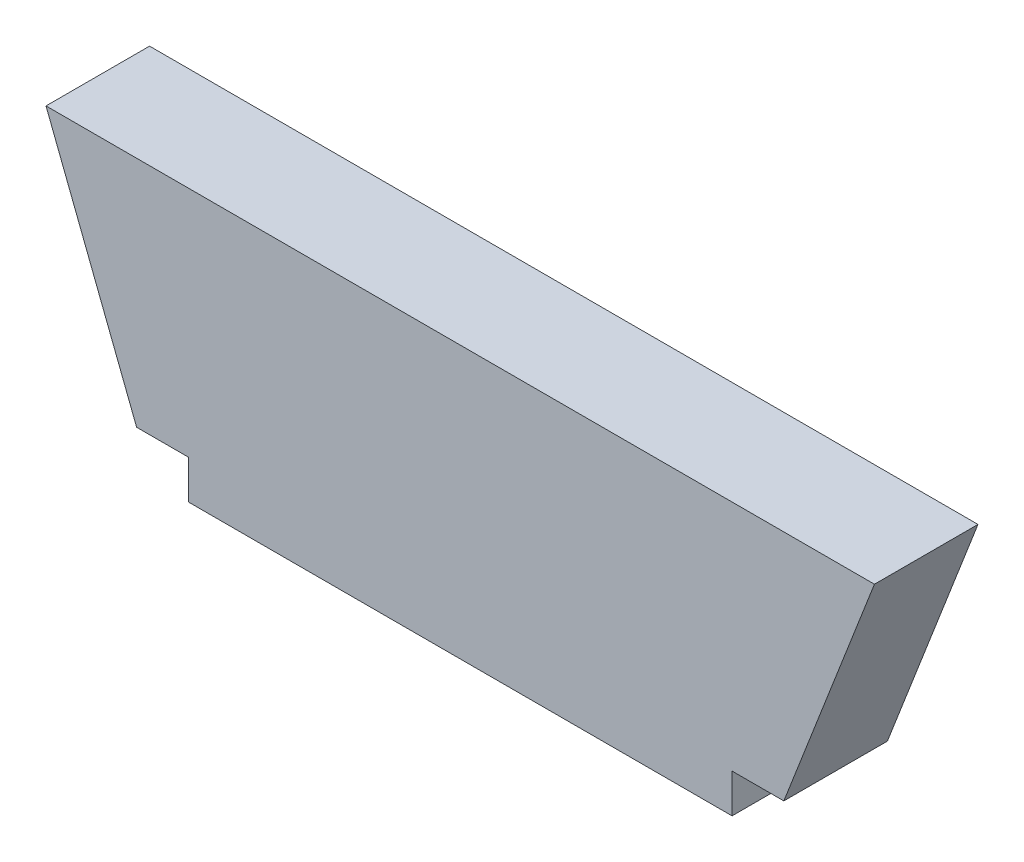
ISO-10303-21;
HEADER;
FILE_DESCRIPTION(('STEP AP214'),'2;1');
FILE_NAME('part.step','',(''),(''),'','','');
FILE_SCHEMA(('AUTOMOTIVE_DESIGN { 1 0 10303 214 1 1 1 1 }'));
ENDSEC;
DATA;
#1=APPLICATION_CONTEXT('core data for automotive mechanical design processes');
#2=APPLICATION_PROTOCOL_DEFINITION('international standard','automotive_design',2000,#1);
#3=PRODUCT_CONTEXT('',#1,'mechanical');
#4=PRODUCT('Part','Part','',(#3));
#5=PRODUCT_RELATED_PRODUCT_CATEGORY('part','',(#4));
#6=PRODUCT_DEFINITION_FORMATION('','',#4);
#7=PRODUCT_DEFINITION_CONTEXT('part definition',#1,'design');
#8=PRODUCT_DEFINITION('design','',#6,#7);
#9=PRODUCT_DEFINITION_SHAPE('','',#8);
#10=(LENGTH_UNIT() NAMED_UNIT(*) SI_UNIT(.MILLI.,.METRE.));
#11=(NAMED_UNIT(*) PLANE_ANGLE_UNIT() SI_UNIT($,.RADIAN.));
#12=(NAMED_UNIT(*) SI_UNIT($,.STERADIAN.) SOLID_ANGLE_UNIT());
#13=UNCERTAINTY_MEASURE_WITH_UNIT(LENGTH_MEASURE(1.E-05),#10,'distance_accuracy_value','');
#14=(GEOMETRIC_REPRESENTATION_CONTEXT(3) GLOBAL_UNCERTAINTY_ASSIGNED_CONTEXT((#13)) GLOBAL_UNIT_ASSIGNED_CONTEXT((#10,
#11,#12)) REPRESENTATION_CONTEXT('',''));
#15=CARTESIAN_POINT('',(0.,0.,0.));
#16=DIRECTION('',(0.,0.,1.));
#17=DIRECTION('',(1.,0.,0.));
#18=AXIS2_PLACEMENT_3D('',#15,#16,#17);
#19=CARTESIAN_POINT('',(-25.,0.,8.));
#20=DIRECTION('',(0.,1.,0.));
#21=DIRECTION('',(0.,0.,1.));
#22=AXIS2_PLACEMENT_3D('',#19,#20,#21);
#23=PLANE('',#22);
#24=DIRECTION('',(1.,0.,0.));
#25=VECTOR('',#24,1.);
#26=CARTESIAN_POINT('',(-25.,0.,0.));
#27=LINE('',#26,#25);
#28=CARTESIAN_POINT('',(-25.,0.,0.));
#29=VERTEX_POINT('',#28);
#30=CARTESIAN_POINT('',(-21.,0.,0.));
#31=VERTEX_POINT('',#30);
#32=EDGE_CURVE('E130',#29,#31,#27,.T.);
#33=ORIENTED_EDGE('',*,*,#32,.T.);
#34=DIRECTION('',(0.,0.,-1.));
#35=VECTOR('',#34,1.);
#36=CARTESIAN_POINT('',(-21.,0.,8.));
#37=LINE('',#36,#35);
#38=CARTESIAN_POINT('',(-21.,0.,8.));
#39=VERTEX_POINT('',#38);
#40=EDGE_CURVE('E11',#39,#31,#37,.T.);
#41=ORIENTED_EDGE('',*,*,#40,.F.);
#42=DIRECTION('',(1.,0.,0.));
#43=VECTOR('',#42,1.);
#44=CARTESIAN_POINT('',(-25.,0.,8.));
#45=LINE('',#44,#43);
#46=CARTESIAN_POINT('',(-25.,0.,8.));
#47=VERTEX_POINT('',#46);
#48=EDGE_CURVE('E144',#47,#39,#45,.T.);
#49=ORIENTED_EDGE('',*,*,#48,.F.);
#50=DIRECTION('',(0.,0.,-1.));
#51=VECTOR('',#50,1.);
#52=CARTESIAN_POINT('',(-25.,0.,8.));
#53=LINE('',#52,#51);
#54=EDGE_CURVE('E126',#47,#29,#53,.T.);
#55=ORIENTED_EDGE('',*,*,#54,.T.);
#56=EDGE_LOOP('',(#33,#41,#49,#55));
#57=FACE_BOUND('',#56,.T.);
#58=ADVANCED_FACE('F34',(#57),#23,.F.);
#59=CARTESIAN_POINT('',(-21.,0.,8.));
#60=DIRECTION('',(1.,0.,0.));
#61=DIRECTION('',(0.,0.,-1.));
#62=AXIS2_PLACEMENT_3D('',#59,#60,#61);
#63=PLANE('',#62);
#64=DIRECTION('',(0.,-1.,0.));
#65=VECTOR('',#64,1.);
#66=CARTESIAN_POINT('',(-21.,0.,0.));
#67=LINE('',#66,#65);
#68=CARTESIAN_POINT('',(-21.,-3.00000000000001,0.));
#69=VERTEX_POINT('',#68);
#70=EDGE_CURVE('E133',#31,#69,#67,.T.);
#71=ORIENTED_EDGE('',*,*,#70,.T.);
#72=DIRECTION('',(0.,0.,-1.));
#73=VECTOR('',#72,1.);
#74=CARTESIAN_POINT('',(-21.,-3.00000000000001,8.));
#75=LINE('',#74,#73);
#76=CARTESIAN_POINT('',(-21.,-3.00000000000001,8.));
#77=VERTEX_POINT('',#76);
#78=EDGE_CURVE('E42',#77,#69,#75,.T.);
#79=ORIENTED_EDGE('',*,*,#78,.F.);
#80=DIRECTION('',(0.,-1.,0.));
#81=VECTOR('',#80,1.);
#82=CARTESIAN_POINT('',(-21.,0.,8.));
#83=LINE('',#82,#81);
#84=EDGE_CURVE('E93',#39,#77,#83,.T.);
#85=ORIENTED_EDGE('',*,*,#84,.F.);
#86=ORIENTED_EDGE('',*,*,#40,.T.);
#87=EDGE_LOOP('',(#71,#79,#85,#86));
#88=FACE_BOUND('',#87,.T.);
#89=ADVANCED_FACE('F179',(#88),#63,.F.);
#90=CARTESIAN_POINT('',(-21.,-3.00000000000001,8.));
#91=DIRECTION('',(0.,1.,0.));
#92=DIRECTION('',(-1.,0.,0.));
#93=AXIS2_PLACEMENT_3D('',#90,#91,#92);
#94=PLANE('',#93);
#95=DIRECTION('',(1.,0.,0.));
#96=VECTOR('',#95,1.);
#97=CARTESIAN_POINT('',(-21.,-3.00000000000001,0.));
#98=LINE('',#97,#96);
#99=CARTESIAN_POINT('',(21.,-3.,0.));
#100=VERTEX_POINT('',#99);
#101=EDGE_CURVE('E135',#69,#100,#98,.T.);
#102=ORIENTED_EDGE('',*,*,#101,.T.);
#103=DIRECTION('',(0.,0.,-1.));
#104=VECTOR('',#103,1.);
#105=CARTESIAN_POINT('',(21.,-3.,8.));
#106=LINE('',#105,#104);
#107=CARTESIAN_POINT('',(21.,-3.,8.));
#108=VERTEX_POINT('',#107);
#109=EDGE_CURVE('E151',#108,#100,#106,.T.);
#110=ORIENTED_EDGE('',*,*,#109,.F.);
#111=DIRECTION('',(1.,0.,0.));
#112=VECTOR('',#111,1.);
#113=CARTESIAN_POINT('',(-21.,-3.00000000000001,8.));
#114=LINE('',#113,#112);
#115=EDGE_CURVE('E159',#77,#108,#114,.T.);
#116=ORIENTED_EDGE('',*,*,#115,.F.);
#117=ORIENTED_EDGE('',*,*,#78,.T.);
#118=EDGE_LOOP('',(#102,#110,#116,#117));
#119=FACE_BOUND('',#118,.T.);
#120=ADVANCED_FACE('F157',(#119),#94,.F.);
#121=CARTESIAN_POINT('',(21.,0.,8.));
#122=DIRECTION('',(-1.,0.,0.));
#123=DIRECTION('',(0.,-1.,0.));
#124=AXIS2_PLACEMENT_3D('',#121,#122,#123);
#125=PLANE('',#124);
#126=DIRECTION('',(0.,1.,0.));
#127=VECTOR('',#126,1.);
#128=CARTESIAN_POINT('',(21.,0.,0.));
#129=LINE('',#128,#127);
#130=CARTESIAN_POINT('',(21.,0.,0.));
#131=VERTEX_POINT('',#130);
#132=EDGE_CURVE('E137',#100,#131,#129,.T.);
#133=ORIENTED_EDGE('',*,*,#132,.T.);
#134=DIRECTION('',(0.,0.,-1.));
#135=VECTOR('',#134,1.);
#136=CARTESIAN_POINT('',(21.,0.,8.));
#137=LINE('',#136,#135);
#138=CARTESIAN_POINT('',(21.,0.,8.));
#139=VERTEX_POINT('',#138);
#140=EDGE_CURVE('E148',#139,#131,#137,.T.);
#141=ORIENTED_EDGE('',*,*,#140,.F.);
#142=DIRECTION('',(0.,1.,0.));
#143=VECTOR('',#142,1.);
#144=CARTESIAN_POINT('',(21.,0.,8.));
#145=LINE('',#144,#143);
#146=EDGE_CURVE('E171',#108,#139,#145,.T.);
#147=ORIENTED_EDGE('',*,*,#146,.F.);
#148=ORIENTED_EDGE('',*,*,#109,.T.);
#149=EDGE_LOOP('',(#133,#141,#147,#148));
#150=FACE_BOUND('',#149,.T.);
#151=ADVANCED_FACE('F167',(#150),#125,.F.);
#152=CARTESIAN_POINT('',(25.,0.,8.));
#153=DIRECTION('',(0.,1.,0.));
#154=DIRECTION('',(-1.,0.,0.));
#155=AXIS2_PLACEMENT_3D('',#152,#153,#154);
#156=PLANE('',#155);
#157=DIRECTION('',(1.,0.,0.));
#158=VECTOR('',#157,1.);
#159=CARTESIAN_POINT('',(25.,0.,0.));
#160=LINE('',#159,#158);
#161=CARTESIAN_POINT('',(25.,0.,0.));
#162=VERTEX_POINT('',#161);
#163=EDGE_CURVE('E139',#131,#162,#160,.T.);
#164=ORIENTED_EDGE('',*,*,#163,.T.);
#165=DIRECTION('',(0.,0.,-1.));
#166=VECTOR('',#165,1.);
#167=CARTESIAN_POINT('',(25.,0.,8.));
#168=LINE('',#167,#166);
#169=CARTESIAN_POINT('',(25.,0.,8.));
#170=VERTEX_POINT('',#169);
#171=EDGE_CURVE('E121',#170,#162,#168,.T.);
#172=ORIENTED_EDGE('',*,*,#171,.F.);
#173=DIRECTION('',(1.,0.,0.));
#174=VECTOR('',#173,1.);
#175=CARTESIAN_POINT('',(25.,0.,8.));
#176=LINE('',#175,#174);
#177=EDGE_CURVE('E112',#139,#170,#176,.T.);
#178=ORIENTED_EDGE('',*,*,#177,.F.);
#179=ORIENTED_EDGE('',*,*,#140,.T.);
#180=EDGE_LOOP('',(#164,#172,#178,#179));
#181=FACE_BOUND('',#180,.T.);
#182=ADVANCED_FACE('F170',(#181),#156,.F.);
#183=CARTESIAN_POINT('',(25.,0.,8.));
#184=DIRECTION('',(-0.932004671541296,0.362446261154948,0.));
#185=DIRECTION('',(-0.362446261154948,-0.932004671541296,0.));
#186=AXIS2_PLACEMENT_3D('',#183,#184,#185);
#187=PLANE('',#186);
#188=DIRECTION('',(0.362446261154948,0.932004671541296,0.));
#189=VECTOR('',#188,1.);
#190=CARTESIAN_POINT('',(25.,0.,0.));
#191=LINE('',#190,#189);
#192=CARTESIAN_POINT('',(32.,18.,0.));
#193=VERTEX_POINT('',#192);
#194=EDGE_CURVE('E120',#162,#193,#191,.T.);
#195=ORIENTED_EDGE('',*,*,#194,.T.);
#196=DIRECTION('',(0.,0.,-1.));
#197=VECTOR('',#196,1.);
#198=CARTESIAN_POINT('',(32.,18.,8.));
#199=LINE('',#198,#197);
#200=CARTESIAN_POINT('',(32.,18.,8.));
#201=VERTEX_POINT('',#200);
#202=EDGE_CURVE('E117',#201,#193,#199,.T.);
#203=ORIENTED_EDGE('',*,*,#202,.F.);
#204=DIRECTION('',(0.362446261154948,0.932004671541296,0.));
#205=VECTOR('',#204,1.);
#206=CARTESIAN_POINT('',(25.,0.,8.));
#207=LINE('',#206,#205);
#208=EDGE_CURVE('E106',#170,#201,#207,.T.);
#209=ORIENTED_EDGE('',*,*,#208,.F.);
#210=ORIENTED_EDGE('',*,*,#171,.T.);
#211=EDGE_LOOP('',(#195,#203,#209,#210));
#212=FACE_BOUND('',#211,.T.);
#213=ADVANCED_FACE('F118',(#212),#187,.F.);
#214=CARTESIAN_POINT('',(-32.,18.,8.));
#215=DIRECTION('',(0.,-1.,0.));
#216=DIRECTION('',(0.,0.,-1.));
#217=AXIS2_PLACEMENT_3D('',#214,#215,#216);
#218=PLANE('',#217);
#219=DIRECTION('',(-1.,0.,0.));
#220=VECTOR('',#219,1.);
#221=CARTESIAN_POINT('',(-32.,18.,0.));
#222=LINE('',#221,#220);
#223=CARTESIAN_POINT('',(-32.,18.,0.));
#224=VERTEX_POINT('',#223);
#225=EDGE_CURVE('E79',#193,#224,#222,.T.);
#226=ORIENTED_EDGE('',*,*,#225,.T.);
#227=DIRECTION('',(0.,0.,-1.));
#228=VECTOR('',#227,1.);
#229=CARTESIAN_POINT('',(-32.,18.,8.));
#230=LINE('',#229,#228);
#231=CARTESIAN_POINT('',(-32.,18.,8.));
#232=VERTEX_POINT('',#231);
#233=EDGE_CURVE('E122',#232,#224,#230,.T.);
#234=ORIENTED_EDGE('',*,*,#233,.F.);
#235=DIRECTION('',(-1.,0.,0.));
#236=VECTOR('',#235,1.);
#237=CARTESIAN_POINT('',(-32.,18.,8.));
#238=LINE('',#237,#236);
#239=EDGE_CURVE('E110',#201,#232,#238,.T.);
#240=ORIENTED_EDGE('',*,*,#239,.F.);
#241=ORIENTED_EDGE('',*,*,#202,.T.);
#242=EDGE_LOOP('',(#226,#234,#240,#241));
#243=FACE_BOUND('',#242,.T.);
#244=ADVANCED_FACE('F124',(#243),#218,.F.);
#245=CARTESIAN_POINT('',(-25.,0.,8.));
#246=DIRECTION('',(0.932004671541296,0.362446261154948,0.));
#247=DIRECTION('',(-0.362446261154948,0.932004671541296,0.));
#248=AXIS2_PLACEMENT_3D('',#245,#246,#247);
#249=PLANE('',#248);
#250=DIRECTION('',(0.362446261154948,-0.932004671541296,0.));
#251=VECTOR('',#250,1.);
#252=CARTESIAN_POINT('',(-25.,0.,0.));
#253=LINE('',#252,#251);
#254=EDGE_CURVE('E85',#224,#29,#253,.T.);
#255=ORIENTED_EDGE('',*,*,#254,.T.);
#256=ORIENTED_EDGE('',*,*,#54,.F.);
#257=DIRECTION('',(0.362446261154948,-0.932004671541296,0.));
#258=VECTOR('',#257,1.);
#259=CARTESIAN_POINT('',(-25.,0.,8.));
#260=LINE('',#259,#258);
#261=EDGE_CURVE('E50',#232,#47,#260,.T.);
#262=ORIENTED_EDGE('',*,*,#261,.F.);
#263=ORIENTED_EDGE('',*,*,#233,.T.);
#264=EDGE_LOOP('',(#255,#256,#262,#263));
#265=FACE_BOUND('',#264,.T.);
#266=ADVANCED_FACE('F195',(#265),#249,.F.);
#267=CARTESIAN_POINT('',(0.,0.,8.));
#268=DIRECTION('',(0.,0.,-1.));
#269=DIRECTION('',(-1.,0.,0.));
#270=AXIS2_PLACEMENT_3D('',#267,#268,#269);
#271=PLANE('',#270);
#272=ORIENTED_EDGE('',*,*,#48,.T.);
#273=ORIENTED_EDGE('',*,*,#84,.T.);
#274=ORIENTED_EDGE('',*,*,#115,.T.);
#275=ORIENTED_EDGE('',*,*,#146,.T.);
#276=ORIENTED_EDGE('',*,*,#177,.T.);
#277=ORIENTED_EDGE('',*,*,#208,.T.);
#278=ORIENTED_EDGE('',*,*,#239,.T.);
#279=ORIENTED_EDGE('',*,*,#261,.T.);
#280=EDGE_LOOP('',(#272,#273,#274,#275,#276,#277,#278,#279));
#281=FACE_BOUND('',#280,.T.);
#282=ADVANCED_FACE('F108',(#281),#271,.F.);
#283=CARTESIAN_POINT('',(0.,0.,0.));
#284=DIRECTION('',(0.,0.,-1.));
#285=DIRECTION('',(-1.,0.,0.));
#286=AXIS2_PLACEMENT_3D('',#283,#284,#285);
#287=PLANE('',#286);
#288=ORIENTED_EDGE('',*,*,#32,.F.);
#289=ORIENTED_EDGE('',*,*,#254,.F.);
#290=ORIENTED_EDGE('',*,*,#225,.F.);
#291=ORIENTED_EDGE('',*,*,#194,.F.);
#292=ORIENTED_EDGE('',*,*,#163,.F.);
#293=ORIENTED_EDGE('',*,*,#132,.F.);
#294=ORIENTED_EDGE('',*,*,#101,.F.);
#295=ORIENTED_EDGE('',*,*,#70,.F.);
#296=EDGE_LOOP('',(#288,#289,#290,#291,#292,#293,#294,#295));
#297=FACE_BOUND('',#296,.T.);
#298=ADVANCED_FACE('F163',(#297),#287,.T.);
#299=CLOSED_SHELL('',(#58,#89,#120,#151,#182,#213,#244,#266,#282,#298));
#300=MANIFOLD_SOLID_BREP('B2',#299);
#301=ADVANCED_BREP_SHAPE_REPRESENTATION('',(#18,#300),#14);
#302=SHAPE_DEFINITION_REPRESENTATION(#9,#301);
ENDSEC;
END-ISO-10303-21;
